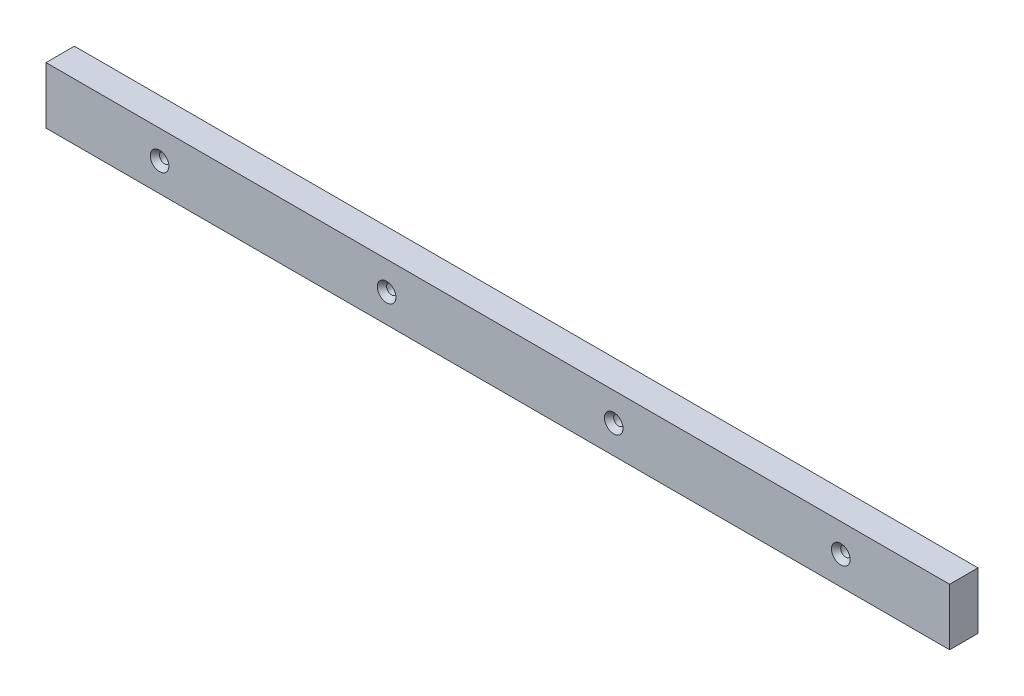
ISO-10303-21;
HEADER;
FILE_DESCRIPTION(('STEP AP214'),'2;1');
FILE_NAME('part.step','',(''),(''),'','','');
FILE_SCHEMA(('AUTOMOTIVE_DESIGN { 1 0 10303 214 1 1 1 1 }'));
ENDSEC;
DATA;
#1=APPLICATION_CONTEXT('core data for automotive mechanical design processes');
#2=APPLICATION_PROTOCOL_DEFINITION('international standard','automotive_design',2000,#1);
#3=PRODUCT_CONTEXT('',#1,'mechanical');
#4=PRODUCT('Part','Part','',(#3));
#5=PRODUCT_RELATED_PRODUCT_CATEGORY('part','',(#4));
#6=PRODUCT_DEFINITION_FORMATION('','',#4);
#7=PRODUCT_DEFINITION_CONTEXT('part definition',#1,'design');
#8=PRODUCT_DEFINITION('design','',#6,#7);
#9=PRODUCT_DEFINITION_SHAPE('','',#8);
#10=(LENGTH_UNIT() NAMED_UNIT(*) SI_UNIT(.MILLI.,.METRE.));
#11=(NAMED_UNIT(*) PLANE_ANGLE_UNIT() SI_UNIT($,.RADIAN.));
#12=(NAMED_UNIT(*) SI_UNIT($,.STERADIAN.) SOLID_ANGLE_UNIT());
#13=UNCERTAINTY_MEASURE_WITH_UNIT(LENGTH_MEASURE(1.E-05),#10,'distance_accuracy_value','');
#14=(GEOMETRIC_REPRESENTATION_CONTEXT(3) GLOBAL_UNCERTAINTY_ASSIGNED_CONTEXT((#13)) GLOBAL_UNIT_ASSIGNED_CONTEXT((#10,
#11,#12)) REPRESENTATION_CONTEXT('',''));
#15=CARTESIAN_POINT('',(0.,0.,0.));
#16=DIRECTION('',(0.,0.,1.));
#17=DIRECTION('',(1.,0.,0.));
#18=AXIS2_PLACEMENT_3D('',#15,#16,#17);
#19=CARTESIAN_POINT('',(0.,0.,19.05));
#20=DIRECTION('',(0.,0.,1.));
#21=DIRECTION('',(1.,0.,0.));
#22=AXIS2_PLACEMENT_3D('',#19,#20,#21);
#23=PLANE('',#22);
#24=CARTESIAN_POINT('',(533.4,-19.05,19.0499999999361));
#25=DIRECTION('',(0.,0.,1.));
#26=DIRECTION('',(1.,0.,0.));
#27=AXIS2_PLACEMENT_3D('',#24,#25,#26);
#28=CIRCLE('',#27,6.24840000000984);
#29=CARTESIAN_POINT('',(539.64840000001,-19.05,19.0499999999361));
#30=VERTEX_POINT('',#29);
#31=EDGE_CURVE('E75',#30,#30,#28,.F.);
#32=ORIENTED_EDGE('',*,*,#31,.T.);
#33=EDGE_LOOP('',(#32));
#34=FACE_BOUND('',#33,.T.);
#35=CARTESIAN_POINT('',(381.,-19.05,19.0499999999361));
#36=DIRECTION('',(0.,0.,1.));
#37=DIRECTION('',(1.,0.,0.));
#38=AXIS2_PLACEMENT_3D('',#35,#36,#37);
#39=CIRCLE('',#38,6.24840000000995);
#40=CARTESIAN_POINT('',(387.24840000001,-19.05,19.0499999999361));
#41=VERTEX_POINT('',#40);
#42=EDGE_CURVE('E107',#41,#41,#39,.F.);
#43=ORIENTED_EDGE('',*,*,#42,.T.);
#44=EDGE_LOOP('',(#43));
#45=FACE_BOUND('',#44,.T.);
#46=CARTESIAN_POINT('',(228.6,-19.05,19.0499999999361));
#47=DIRECTION('',(0.,0.,1.));
#48=DIRECTION('',(1.,0.,0.));
#49=AXIS2_PLACEMENT_3D('',#46,#47,#48);
#50=CIRCLE('',#49,6.24840000001003);
#51=CARTESIAN_POINT('',(234.84840000001,-19.05,19.0499999999361));
#52=VERTEX_POINT('',#51);
#53=EDGE_CURVE('E109',#52,#52,#50,.F.);
#54=ORIENTED_EDGE('',*,*,#53,.T.);
#55=EDGE_LOOP('',(#54));
#56=FACE_BOUND('',#55,.T.);
#57=CARTESIAN_POINT('',(76.2,-19.05,19.0499999999361));
#58=DIRECTION('',(0.,0.,1.));
#59=DIRECTION('',(1.,0.,0.));
#60=AXIS2_PLACEMENT_3D('',#57,#58,#59);
#61=CIRCLE('',#60,6.24840000001012);
#62=CARTESIAN_POINT('',(82.4484000000101,-19.05,19.0499999999361));
#63=VERTEX_POINT('',#62);
#64=EDGE_CURVE('E20',#63,#63,#61,.F.);
#65=ORIENTED_EDGE('',*,*,#64,.T.);
#66=EDGE_LOOP('',(#65));
#67=FACE_BOUND('',#66,.T.);
#68=DIRECTION('',(1.,0.,0.));
#69=VECTOR('',#68,1.);
#70=CARTESIAN_POINT('',(606.425,0.,19.05));
#71=LINE('',#70,#69);
#72=CARTESIAN_POINT('',(0.,0.,19.05));
#73=VERTEX_POINT('',#72);
#74=CARTESIAN_POINT('',(606.425,0.,19.05));
#75=VERTEX_POINT('',#74);
#76=EDGE_CURVE('E71',#73,#75,#71,.T.);
#77=ORIENTED_EDGE('',*,*,#76,.F.);
#78=DIRECTION('',(0.,1.,0.));
#79=VECTOR('',#78,1.);
#80=CARTESIAN_POINT('',(0.,0.,19.05));
#81=LINE('',#80,#79);
#82=CARTESIAN_POINT('',(0.,-38.1,19.05));
#83=VERTEX_POINT('',#82);
#84=EDGE_CURVE('E68',#83,#73,#81,.T.);
#85=ORIENTED_EDGE('',*,*,#84,.F.);
#86=DIRECTION('',(1.,0.,0.));
#87=VECTOR('',#86,1.);
#88=CARTESIAN_POINT('',(0.,-38.1,19.05));
#89=LINE('',#88,#87);
#90=CARTESIAN_POINT('',(606.425,-38.1,19.05));
#91=VERTEX_POINT('',#90);
#92=EDGE_CURVE('E59',#91,#83,#89,.F.);
#93=ORIENTED_EDGE('',*,*,#92,.F.);
#94=DIRECTION('',(0.,1.,0.));
#95=VECTOR('',#94,1.);
#96=CARTESIAN_POINT('',(606.425,-38.1,19.05));
#97=LINE('',#96,#95);
#98=EDGE_CURVE('E54',#75,#91,#97,.F.);
#99=ORIENTED_EDGE('',*,*,#98,.F.);
#100=EDGE_LOOP('',(#77,#85,#93,#99));
#101=FACE_BOUND('',#100,.T.);
#102=ADVANCED_FACE('F17',(#34,#45,#56,#67,#101),#23,.T.);
#103=CARTESIAN_POINT('',(76.2,-19.05,19.0499999997655));
#104=DIRECTION('',(0.,0.,1.));
#105=DIRECTION('',(1.,0.,0.));
#106=AXIS2_PLACEMENT_3D('',#103,#104,#105);
#107=CONICAL_SURFACE('',#106,6.24839999986188,0.715584993326319);
#108=CARTESIAN_POINT('',(76.2,-19.05,15.7336029188222));
#109=DIRECTION('',(0.,0.,1.));
#110=DIRECTION('',(1.,0.,0.));
#111=AXIS2_PLACEMENT_3D('',#108,#109,#110);
#112=CIRCLE('',#111,3.3655);
#113=CARTESIAN_POINT('',(79.5655,-19.05,15.7336029188222));
#114=VERTEX_POINT('',#113);
#115=EDGE_CURVE('E93',#114,#114,#112,.F.);
#116=ORIENTED_EDGE('',*,*,#115,.T.);
#117=EDGE_LOOP('',(#116));
#118=FACE_BOUND('',#117,.T.);
#119=ORIENTED_EDGE('',*,*,#64,.F.);
#120=EDGE_LOOP('',(#119));
#121=FACE_BOUND('',#120,.T.);
#122=ADVANCED_FACE('F117',(#118,#121),#107,.F.);
#123=CARTESIAN_POINT('',(228.6,-19.05,19.0499999997655));
#124=DIRECTION('',(0.,0.,1.));
#125=DIRECTION('',(1.,0.,0.));
#126=AXIS2_PLACEMENT_3D('',#123,#124,#125);
#127=CONICAL_SURFACE('',#126,6.24839999986179,0.715584993326319);
#128=CARTESIAN_POINT('',(228.6,-19.05,15.7336029188222));
#129=DIRECTION('',(0.,0.,1.));
#130=DIRECTION('',(1.,0.,0.));
#131=AXIS2_PLACEMENT_3D('',#128,#129,#130);
#132=CIRCLE('',#131,3.3655);
#133=CARTESIAN_POINT('',(231.9655,-19.05,15.7336029188222));
#134=VERTEX_POINT('',#133);
#135=EDGE_CURVE('E90',#134,#134,#132,.F.);
#136=ORIENTED_EDGE('',*,*,#135,.T.);
#137=EDGE_LOOP('',(#136));
#138=FACE_BOUND('',#137,.T.);
#139=ORIENTED_EDGE('',*,*,#53,.F.);
#140=EDGE_LOOP('',(#139));
#141=FACE_BOUND('',#140,.T.);
#142=ADVANCED_FACE('F119',(#138,#141),#127,.F.);
#143=CARTESIAN_POINT('',(381.,-19.05,19.0499999997655));
#144=DIRECTION('',(0.,0.,1.));
#145=DIRECTION('',(1.,0.,0.));
#146=AXIS2_PLACEMENT_3D('',#143,#144,#145);
#147=CONICAL_SURFACE('',#146,6.24839999986171,0.715584993314004);
#148=CARTESIAN_POINT('',(381.,-19.05,15.7336029188222));
#149=DIRECTION('',(0.,0.,1.));
#150=DIRECTION('',(1.,0.,0.));
#151=AXIS2_PLACEMENT_3D('',#148,#149,#150);
#152=CIRCLE('',#151,3.3655);
#153=CARTESIAN_POINT('',(384.3655,-19.05,15.7336029188222));
#154=VERTEX_POINT('',#153);
#155=EDGE_CURVE('E87',#154,#154,#152,.F.);
#156=ORIENTED_EDGE('',*,*,#155,.T.);
#157=EDGE_LOOP('',(#156));
#158=FACE_BOUND('',#157,.T.);
#159=ORIENTED_EDGE('',*,*,#42,.F.);
#160=EDGE_LOOP('',(#159));
#161=FACE_BOUND('',#160,.T.);
#162=ADVANCED_FACE('F126',(#158,#161),#147,.F.);
#163=CARTESIAN_POINT('',(533.4,-19.05,19.0499999997655));
#164=DIRECTION('',(0.,0.,1.));
#165=DIRECTION('',(1.,0.,0.));
#166=AXIS2_PLACEMENT_3D('',#163,#164,#165);
#167=CONICAL_SURFACE('',#166,6.2483999998616,0.715584993314004);
#168=CARTESIAN_POINT('',(533.4,-19.05,15.7336029188222));
#169=DIRECTION('',(0.,0.,1.));
#170=DIRECTION('',(1.,0.,0.));
#171=AXIS2_PLACEMENT_3D('',#168,#169,#170);
#172=CIRCLE('',#171,3.3655);
#173=CARTESIAN_POINT('',(536.7655,-19.05,15.7336029188222));
#174=VERTEX_POINT('',#173);
#175=EDGE_CURVE('E84',#174,#174,#172,.F.);
#176=ORIENTED_EDGE('',*,*,#175,.T.);
#177=EDGE_LOOP('',(#176));
#178=FACE_BOUND('',#177,.T.);
#179=ORIENTED_EDGE('',*,*,#31,.F.);
#180=EDGE_LOOP('',(#179));
#181=FACE_BOUND('',#180,.T.);
#182=ADVANCED_FACE('F165',(#178,#181),#167,.F.);
#183=CARTESIAN_POINT('',(0.,0.,0.));
#184=DIRECTION('',(-1.,0.,0.));
#185=DIRECTION('',(0.,0.,1.));
#186=AXIS2_PLACEMENT_3D('',#183,#184,#185);
#187=PLANE('',#186);
#188=DIRECTION('',(0.,0.,1.));
#189=VECTOR('',#188,1.);
#190=CARTESIAN_POINT('',(0.,0.,0.));
#191=LINE('',#190,#189);
#192=CARTESIAN_POINT('',(0.,0.,0.));
#193=VERTEX_POINT('',#192);
#194=EDGE_CURVE('E195',#193,#73,#191,.T.);
#195=ORIENTED_EDGE('',*,*,#194,.F.);
#196=DIRECTION('',(0.,1.,0.));
#197=VECTOR('',#196,1.);
#198=CARTESIAN_POINT('',(0.,0.,0.));
#199=LINE('',#198,#197);
#200=CARTESIAN_POINT('',(0.,-38.1,0.));
#201=VERTEX_POINT('',#200);
#202=EDGE_CURVE('E79',#193,#201,#199,.F.);
#203=ORIENTED_EDGE('',*,*,#202,.T.);
#204=DIRECTION('',(0.,0.,-1.));
#205=VECTOR('',#204,1.);
#206=CARTESIAN_POINT('',(0.,-38.1,0.));
#207=LINE('',#206,#205);
#208=EDGE_CURVE('E64',#83,#201,#207,.T.);
#209=ORIENTED_EDGE('',*,*,#208,.F.);
#210=ORIENTED_EDGE('',*,*,#84,.T.);
#211=EDGE_LOOP('',(#195,#203,#209,#210));
#212=FACE_BOUND('',#211,.T.);
#213=ADVANCED_FACE('F78',(#212),#187,.T.);
#214=CARTESIAN_POINT('',(0.,-38.1,0.));
#215=DIRECTION('',(0.,-1.,0.));
#216=DIRECTION('',(0.,0.,-1.));
#217=AXIS2_PLACEMENT_3D('',#214,#215,#216);
#218=PLANE('',#217);
#219=ORIENTED_EDGE('',*,*,#208,.T.);
#220=DIRECTION('',(1.,0.,0.));
#221=VECTOR('',#220,1.);
#222=CARTESIAN_POINT('',(0.,-38.1,0.));
#223=LINE('',#222,#221);
#224=CARTESIAN_POINT('',(606.425,-38.1,0.));
#225=VERTEX_POINT('',#224);
#226=EDGE_CURVE('E187',#201,#225,#223,.T.);
#227=ORIENTED_EDGE('',*,*,#226,.T.);
#228=DIRECTION('',(0.,0.,-1.));
#229=VECTOR('',#228,1.);
#230=CARTESIAN_POINT('',(606.425,-38.1,0.));
#231=LINE('',#230,#229);
#232=EDGE_CURVE('E66',#91,#225,#231,.T.);
#233=ORIENTED_EDGE('',*,*,#232,.F.);
#234=ORIENTED_EDGE('',*,*,#92,.T.);
#235=EDGE_LOOP('',(#219,#227,#233,#234));
#236=FACE_BOUND('',#235,.T.);
#237=ADVANCED_FACE('F61',(#236),#218,.T.);
#238=CARTESIAN_POINT('',(606.425,-38.1,0.));
#239=DIRECTION('',(1.,0.,0.));
#240=DIRECTION('',(0.,0.,-1.));
#241=AXIS2_PLACEMENT_3D('',#238,#239,#240);
#242=PLANE('',#241);
#243=ORIENTED_EDGE('',*,*,#232,.T.);
#244=DIRECTION('',(0.,1.,0.));
#245=VECTOR('',#244,1.);
#246=CARTESIAN_POINT('',(606.425,0.,0.));
#247=LINE('',#246,#245);
#248=CARTESIAN_POINT('',(606.425,0.,0.));
#249=VERTEX_POINT('',#248);
#250=EDGE_CURVE('E186',#225,#249,#247,.T.);
#251=ORIENTED_EDGE('',*,*,#250,.T.);
#252=DIRECTION('',(0.,0.,1.));
#253=VECTOR('',#252,1.);
#254=CARTESIAN_POINT('',(606.425,0.,0.));
#255=LINE('',#254,#253);
#256=EDGE_CURVE('E35',#75,#249,#255,.F.);
#257=ORIENTED_EDGE('',*,*,#256,.F.);
#258=ORIENTED_EDGE('',*,*,#98,.T.);
#259=EDGE_LOOP('',(#243,#251,#257,#258));
#260=FACE_BOUND('',#259,.T.);
#261=ADVANCED_FACE('F158',(#260),#242,.T.);
#262=CARTESIAN_POINT('',(606.425,0.,0.));
#263=DIRECTION('',(0.,1.,0.));
#264=DIRECTION('',(0.,0.,1.));
#265=AXIS2_PLACEMENT_3D('',#262,#263,#264);
#266=PLANE('',#265);
#267=ORIENTED_EDGE('',*,*,#256,.T.);
#268=DIRECTION('',(1.,0.,0.));
#269=VECTOR('',#268,1.);
#270=CARTESIAN_POINT('',(0.,0.,0.));
#271=LINE('',#270,#269);
#272=EDGE_CURVE('E104',#249,#193,#271,.F.);
#273=ORIENTED_EDGE('',*,*,#272,.T.);
#274=ORIENTED_EDGE('',*,*,#194,.T.);
#275=ORIENTED_EDGE('',*,*,#76,.T.);
#276=EDGE_LOOP('',(#267,#273,#274,#275));
#277=FACE_BOUND('',#276,.T.);
#278=ADVANCED_FACE('F154',(#277),#266,.T.);
#279=CARTESIAN_POINT('',(76.2,-19.05,-2.95275));
#280=DIRECTION('',(0.,0.,1.));
#281=DIRECTION('',(1.,0.,0.));
#282=AXIS2_PLACEMENT_3D('',#279,#280,#281);
#283=CYLINDRICAL_SURFACE('',#282,3.3655);
#284=ORIENTED_EDGE('',*,*,#115,.F.);
#285=EDGE_LOOP('',(#284));
#286=FACE_BOUND('',#285,.T.);
#287=CARTESIAN_POINT('',(76.2,-19.05,0.));
#288=DIRECTION('',(0.,0.,1.));
#289=DIRECTION('',(1.,0.,0.));
#290=AXIS2_PLACEMENT_3D('',#287,#288,#289);
#291=CIRCLE('',#290,3.3655);
#292=CARTESIAN_POINT('',(79.5655,-19.05,0.));
#293=VERTEX_POINT('',#292);
#294=EDGE_CURVE('E101',#293,#293,#291,.F.);
#295=ORIENTED_EDGE('',*,*,#294,.T.);
#296=EDGE_LOOP('',(#295));
#297=FACE_BOUND('',#296,.T.);
#298=ADVANCED_FACE('F150',(#286,#297),#283,.F.);
#299=CARTESIAN_POINT('',(228.6,-19.05,-2.95275));
#300=DIRECTION('',(0.,0.,1.));
#301=DIRECTION('',(1.,0.,0.));
#302=AXIS2_PLACEMENT_3D('',#299,#300,#301);
#303=CYLINDRICAL_SURFACE('',#302,3.3655);
#304=ORIENTED_EDGE('',*,*,#135,.F.);
#305=EDGE_LOOP('',(#304));
#306=FACE_BOUND('',#305,.T.);
#307=CARTESIAN_POINT('',(228.6,-19.05,0.));
#308=DIRECTION('',(0.,0.,1.));
#309=DIRECTION('',(1.,0.,0.));
#310=AXIS2_PLACEMENT_3D('',#307,#308,#309);
#311=CIRCLE('',#310,3.3655);
#312=CARTESIAN_POINT('',(231.9655,-19.05,0.));
#313=VERTEX_POINT('',#312);
#314=EDGE_CURVE('E98',#313,#313,#311,.F.);
#315=ORIENTED_EDGE('',*,*,#314,.T.);
#316=EDGE_LOOP('',(#315));
#317=FACE_BOUND('',#316,.T.);
#318=ADVANCED_FACE('F146',(#306,#317),#303,.F.);
#319=CARTESIAN_POINT('',(381.,-19.05,-2.95275));
#320=DIRECTION('',(0.,0.,1.));
#321=DIRECTION('',(1.,0.,0.));
#322=AXIS2_PLACEMENT_3D('',#319,#320,#321);
#323=CYLINDRICAL_SURFACE('',#322,3.3655);
#324=ORIENTED_EDGE('',*,*,#155,.F.);
#325=EDGE_LOOP('',(#324));
#326=FACE_BOUND('',#325,.T.);
#327=CARTESIAN_POINT('',(381.,-19.05,0.));
#328=DIRECTION('',(0.,0.,1.));
#329=DIRECTION('',(1.,0.,0.));
#330=AXIS2_PLACEMENT_3D('',#327,#328,#329);
#331=CIRCLE('',#330,3.3655);
#332=CARTESIAN_POINT('',(384.3655,-19.05,0.));
#333=VERTEX_POINT('',#332);
#334=EDGE_CURVE('E26',#333,#333,#331,.F.);
#335=ORIENTED_EDGE('',*,*,#334,.T.);
#336=EDGE_LOOP('',(#335));
#337=FACE_BOUND('',#336,.T.);
#338=ADVANCED_FACE('F138',(#326,#337),#323,.F.);
#339=CARTESIAN_POINT('',(533.4,-19.05,-2.95275));
#340=DIRECTION('',(0.,0.,1.));
#341=DIRECTION('',(1.,0.,0.));
#342=AXIS2_PLACEMENT_3D('',#339,#340,#341);
#343=CYLINDRICAL_SURFACE('',#342,3.3655);
#344=ORIENTED_EDGE('',*,*,#175,.F.);
#345=EDGE_LOOP('',(#344));
#346=FACE_BOUND('',#345,.T.);
#347=CARTESIAN_POINT('',(533.4,-19.05,0.));
#348=DIRECTION('',(0.,0.,1.));
#349=DIRECTION('',(1.,0.,0.));
#350=AXIS2_PLACEMENT_3D('',#347,#348,#349);
#351=CIRCLE('',#350,3.3655);
#352=CARTESIAN_POINT('',(536.7655,-19.05,0.));
#353=VERTEX_POINT('',#352);
#354=EDGE_CURVE('E11',#353,#353,#351,.F.);
#355=ORIENTED_EDGE('',*,*,#354,.T.);
#356=EDGE_LOOP('',(#355));
#357=FACE_BOUND('',#356,.T.);
#358=ADVANCED_FACE('F132',(#346,#357),#343,.F.);
#359=CARTESIAN_POINT('',(0.,0.,0.));
#360=DIRECTION('',(0.,0.,1.));
#361=DIRECTION('',(1.,0.,0.));
#362=AXIS2_PLACEMENT_3D('',#359,#360,#361);
#363=PLANE('',#362);
#364=ORIENTED_EDGE('',*,*,#354,.F.);
#365=EDGE_LOOP('',(#364));
#366=FACE_BOUND('',#365,.T.);
#367=ORIENTED_EDGE('',*,*,#334,.F.);
#368=EDGE_LOOP('',(#367));
#369=FACE_BOUND('',#368,.T.);
#370=ORIENTED_EDGE('',*,*,#314,.F.);
#371=EDGE_LOOP('',(#370));
#372=FACE_BOUND('',#371,.T.);
#373=ORIENTED_EDGE('',*,*,#294,.F.);
#374=EDGE_LOOP('',(#373));
#375=FACE_BOUND('',#374,.T.);
#376=ORIENTED_EDGE('',*,*,#250,.F.);
#377=ORIENTED_EDGE('',*,*,#226,.F.);
#378=ORIENTED_EDGE('',*,*,#202,.F.);
#379=ORIENTED_EDGE('',*,*,#272,.F.);
#380=EDGE_LOOP('',(#376,#377,#378,#379));
#381=FACE_BOUND('',#380,.T.);
#382=ADVANCED_FACE('F130',(#366,#369,#372,#375,#381),#363,.F.);
#383=CLOSED_SHELL('',(#102,#122,#142,#162,#182,#213,#237,#261,#278,#298,#318,#338,#358,#382));
#384=MANIFOLD_SOLID_BREP('B1',#383);
#385=ADVANCED_BREP_SHAPE_REPRESENTATION('',(#18,#384),#14);
#386=SHAPE_DEFINITION_REPRESENTATION(#9,#385);
ENDSEC;
END-ISO-10303-21;
